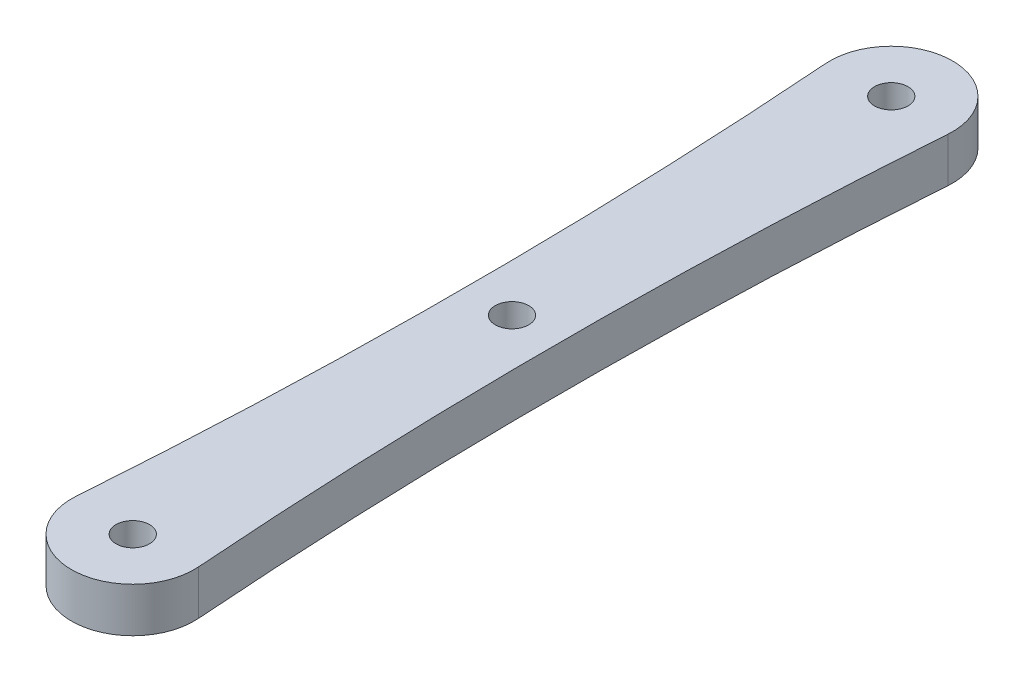
ISO-10303-21;
HEADER;
FILE_DESCRIPTION(('STEP AP214'),'2;1');
FILE_NAME('part.step','',(''),(''),'','','');
FILE_SCHEMA(('AUTOMOTIVE_DESIGN { 1 0 10303 214 1 1 1 1 }'));
ENDSEC;
DATA;
#1=APPLICATION_CONTEXT('core data for automotive mechanical design processes');
#2=APPLICATION_PROTOCOL_DEFINITION('international standard','automotive_design',2000,#1);
#3=PRODUCT_CONTEXT('',#1,'mechanical');
#4=PRODUCT('Part','Part','',(#3));
#5=PRODUCT_RELATED_PRODUCT_CATEGORY('part','',(#4));
#6=PRODUCT_DEFINITION_FORMATION('','',#4);
#7=PRODUCT_DEFINITION_CONTEXT('part definition',#1,'design');
#8=PRODUCT_DEFINITION('design','',#6,#7);
#9=PRODUCT_DEFINITION_SHAPE('','',#8);
#10=(LENGTH_UNIT() NAMED_UNIT(*) SI_UNIT(.MILLI.,.METRE.));
#11=(NAMED_UNIT(*) PLANE_ANGLE_UNIT() SI_UNIT($,.RADIAN.));
#12=(NAMED_UNIT(*) SI_UNIT($,.STERADIAN.) SOLID_ANGLE_UNIT());
#13=UNCERTAINTY_MEASURE_WITH_UNIT(LENGTH_MEASURE(1.E-05),#10,'distance_accuracy_value','');
#14=(GEOMETRIC_REPRESENTATION_CONTEXT(3) GLOBAL_UNCERTAINTY_ASSIGNED_CONTEXT((#13)) GLOBAL_UNIT_ASSIGNED_CONTEXT((#10,
#11,#12)) REPRESENTATION_CONTEXT('',''));
#15=CARTESIAN_POINT('',(0.,0.,0.));
#16=DIRECTION('',(0.,0.,1.));
#17=DIRECTION('',(1.,0.,0.));
#18=AXIS2_PLACEMENT_3D('',#15,#16,#17);
#19=CARTESIAN_POINT('',(-230.8875,4.,-16.9999999999999));
#20=DIRECTION('',(0.,-1.,0.));
#21=DIRECTION('',(0.,0.,-1.));
#22=AXIS2_PLACEMENT_3D('',#19,#20,#21);
#23=PLANE('',#22);
#24=CARTESIAN_POINT('',(-461.775,4.,-33.9999999999999));
#25=DIRECTION('',(0.,-1.,0.));
#26=DIRECTION('',(0.,0.,-1.));
#27=AXIS2_PLACEMENT_3D('',#24,#25,#26);
#28=CIRCLE('',#27,457.525);
#29=CARTESIAN_POINT('',(-5.48515198963337,4.,-67.5961341180282));
#30=VERTEX_POINT('',#29);
#31=CARTESIAN_POINT('',(-5.48515198963338,4.,-0.403865881971815));
#32=VERTEX_POINT('',#31);
#33=EDGE_CURVE('E83',#30,#32,#28,.T.);
#34=ORIENTED_EDGE('',*,*,#33,.T.);
#35=CARTESIAN_POINT('',(0.,4.,0.));
#36=DIRECTION('',(0.,1.,0.));
#37=DIRECTION('',(0.,0.,1.));
#38=AXIS2_PLACEMENT_3D('',#35,#36,#37);
#39=CIRCLE('',#38,5.49999999999999);
#40=CARTESIAN_POINT('',(5.48515198963334,4.,-0.403865881971853));
#41=VERTEX_POINT('',#40);
#42=EDGE_CURVE('E78',#32,#41,#39,.T.);
#43=ORIENTED_EDGE('',*,*,#42,.T.);
#44=CARTESIAN_POINT('',(461.775,4.,-33.9999999999999));
#45=DIRECTION('',(0.,-1.,0.));
#46=DIRECTION('',(0.,0.,1.));
#47=AXIS2_PLACEMENT_3D('',#44,#45,#46);
#48=CIRCLE('',#47,457.525);
#49=CARTESIAN_POINT('',(5.48515198963335,4.,-67.5961341180282));
#50=VERTEX_POINT('',#49);
#51=EDGE_CURVE('E81',#41,#50,#48,.T.);
#52=ORIENTED_EDGE('',*,*,#51,.T.);
#53=CARTESIAN_POINT('',(0.,4.,-68.));
#54=DIRECTION('',(0.,1.,0.));
#55=DIRECTION('',(0.,0.,1.));
#56=AXIS2_PLACEMENT_3D('',#53,#54,#55);
#57=CIRCLE('',#56,5.49999999999997);
#58=EDGE_CURVE('E48',#50,#30,#57,.T.);
#59=ORIENTED_EDGE('',*,*,#58,.T.);
#60=EDGE_LOOP('',(#34,#43,#52,#59));
#61=FACE_BOUND('',#60,.T.);
#62=CARTESIAN_POINT('',(0.,4.,-34.));
#63=DIRECTION('',(0.,1.,0.));
#64=DIRECTION('',(0.,0.,1.));
#65=AXIS2_PLACEMENT_3D('',#62,#63,#64);
#66=CIRCLE('',#65,1.5);
#67=CARTESIAN_POINT('',(0.,4.,-32.5));
#68=VERTEX_POINT('',#67);
#69=EDGE_CURVE('E98',#68,#68,#66,.T.);
#70=ORIENTED_EDGE('',*,*,#69,.F.);
#71=EDGE_LOOP('',(#70));
#72=FACE_BOUND('',#71,.T.);
#73=CARTESIAN_POINT('',(0.,4.,0.));
#74=DIRECTION('',(0.,1.,0.));
#75=DIRECTION('',(0.,0.,1.));
#76=AXIS2_PLACEMENT_3D('',#73,#74,#75);
#77=CIRCLE('',#76,1.5);
#78=CARTESIAN_POINT('',(0.,4.,1.5));
#79=VERTEX_POINT('',#78);
#80=EDGE_CURVE('E113',#79,#79,#77,.T.);
#81=ORIENTED_EDGE('',*,*,#80,.F.);
#82=EDGE_LOOP('',(#81));
#83=FACE_BOUND('',#82,.T.);
#84=CARTESIAN_POINT('',(0.,4.,-68.));
#85=DIRECTION('',(0.,1.,0.));
#86=DIRECTION('',(0.,0.,1.));
#87=AXIS2_PLACEMENT_3D('',#84,#85,#86);
#88=CIRCLE('',#87,1.5);
#89=CARTESIAN_POINT('',(0.,4.,-66.5));
#90=VERTEX_POINT('',#89);
#91=EDGE_CURVE('E119',#90,#90,#88,.T.);
#92=ORIENTED_EDGE('',*,*,#91,.F.);
#93=EDGE_LOOP('',(#92));
#94=FACE_BOUND('',#93,.T.);
#95=ADVANCED_FACE('F31',(#61,#72,#83,#94),#23,.F.);
#96=CARTESIAN_POINT('',(-230.8875,0.,-16.9999999999999));
#97=DIRECTION('',(0.,-1.,0.));
#98=DIRECTION('',(0.,0.,-1.));
#99=AXIS2_PLACEMENT_3D('',#96,#97,#98);
#100=PLANE('',#99);
#101=CARTESIAN_POINT('',(0.,0.,0.));
#102=DIRECTION('',(0.,1.,0.));
#103=DIRECTION('',(0.,0.,1.));
#104=AXIS2_PLACEMENT_3D('',#101,#102,#103);
#105=CIRCLE('',#104,1.5);
#106=CARTESIAN_POINT('',(0.,0.,1.5));
#107=VERTEX_POINT('',#106);
#108=EDGE_CURVE('E116',#107,#107,#105,.T.);
#109=ORIENTED_EDGE('',*,*,#108,.T.);
#110=EDGE_LOOP('',(#109));
#111=FACE_BOUND('',#110,.T.);
#112=CARTESIAN_POINT('',(-461.775,0.,-33.9999999999999));
#113=DIRECTION('',(0.,-1.,0.));
#114=DIRECTION('',(0.,0.,-1.));
#115=AXIS2_PLACEMENT_3D('',#112,#113,#114);
#116=CIRCLE('',#115,457.525);
#117=CARTESIAN_POINT('',(-5.48515198963337,0.,-67.5961341180282));
#118=VERTEX_POINT('',#117);
#119=CARTESIAN_POINT('',(-5.48515198963338,0.,-0.403865881971815));
#120=VERTEX_POINT('',#119);
#121=EDGE_CURVE('E95',#118,#120,#116,.T.);
#122=ORIENTED_EDGE('',*,*,#121,.F.);
#123=CARTESIAN_POINT('',(0.,0.,-68.));
#124=DIRECTION('',(0.,1.,0.));
#125=DIRECTION('',(0.,0.,1.));
#126=AXIS2_PLACEMENT_3D('',#123,#124,#125);
#127=CIRCLE('',#126,5.49999999999997);
#128=CARTESIAN_POINT('',(5.48515198963335,0.,-67.5961341180282));
#129=VERTEX_POINT('',#128);
#130=EDGE_CURVE('E71',#129,#118,#127,.T.);
#131=ORIENTED_EDGE('',*,*,#130,.F.);
#132=CARTESIAN_POINT('',(461.775,0.,-33.9999999999999));
#133=DIRECTION('',(0.,-1.,0.));
#134=DIRECTION('',(0.,0.,1.));
#135=AXIS2_PLACEMENT_3D('',#132,#133,#134);
#136=CIRCLE('',#135,457.525);
#137=CARTESIAN_POINT('',(5.48515198963334,0.,-0.403865881971853));
#138=VERTEX_POINT('',#137);
#139=EDGE_CURVE('E65',#138,#129,#136,.T.);
#140=ORIENTED_EDGE('',*,*,#139,.F.);
#141=CARTESIAN_POINT('',(0.,0.,0.));
#142=DIRECTION('',(0.,1.,0.));
#143=DIRECTION('',(0.,0.,1.));
#144=AXIS2_PLACEMENT_3D('',#141,#142,#143);
#145=CIRCLE('',#144,5.49999999999999);
#146=EDGE_CURVE('E87',#120,#138,#145,.T.);
#147=ORIENTED_EDGE('',*,*,#146,.F.);
#148=EDGE_LOOP('',(#122,#131,#140,#147));
#149=FACE_BOUND('',#148,.T.);
#150=CARTESIAN_POINT('',(0.,0.,-34.));
#151=DIRECTION('',(0.,1.,0.));
#152=DIRECTION('',(0.,0.,1.));
#153=AXIS2_PLACEMENT_3D('',#150,#151,#152);
#154=CIRCLE('',#153,1.5);
#155=CARTESIAN_POINT('',(0.,0.,-32.5));
#156=VERTEX_POINT('',#155);
#157=EDGE_CURVE('E110',#156,#156,#154,.T.);
#158=ORIENTED_EDGE('',*,*,#157,.T.);
#159=EDGE_LOOP('',(#158));
#160=FACE_BOUND('',#159,.T.);
#161=CARTESIAN_POINT('',(0.,0.,-68.));
#162=DIRECTION('',(0.,1.,0.));
#163=DIRECTION('',(0.,0.,1.));
#164=AXIS2_PLACEMENT_3D('',#161,#162,#163);
#165=CIRCLE('',#164,1.5);
#166=CARTESIAN_POINT('',(0.,0.,-66.5));
#167=VERTEX_POINT('',#166);
#168=EDGE_CURVE('E122',#167,#167,#165,.T.);
#169=ORIENTED_EDGE('',*,*,#168,.T.);
#170=EDGE_LOOP('',(#169));
#171=FACE_BOUND('',#170,.T.);
#172=ADVANCED_FACE('F106',(#111,#149,#160,#171),#100,.T.);
#173=CARTESIAN_POINT('',(-461.775,4.,-33.9999999999999));
#174=DIRECTION('',(0.,-1.,0.));
#175=DIRECTION('',(0.,0.,-1.));
#176=AXIS2_PLACEMENT_3D('',#173,#174,#175);
#177=CYLINDRICAL_SURFACE('',#176,457.525);
#178=ORIENTED_EDGE('',*,*,#121,.T.);
#179=DIRECTION('',(0.,-1.,0.));
#180=VECTOR('',#179,1.);
#181=CARTESIAN_POINT('',(-5.48515198963338,4.,-0.403865881971815));
#182=LINE('',#181,#180);
#183=EDGE_CURVE('E11',#32,#120,#182,.T.);
#184=ORIENTED_EDGE('',*,*,#183,.F.);
#185=ORIENTED_EDGE('',*,*,#33,.F.);
#186=DIRECTION('',(0.,-1.,0.));
#187=VECTOR('',#186,1.);
#188=CARTESIAN_POINT('',(-5.48515198963337,4.,-67.5961341180282));
#189=LINE('',#188,#187);
#190=EDGE_CURVE('E91',#30,#118,#189,.T.);
#191=ORIENTED_EDGE('',*,*,#190,.T.);
#192=EDGE_LOOP('',(#178,#184,#185,#191));
#193=FACE_BOUND('',#192,.T.);
#194=ADVANCED_FACE('F33',(#193),#177,.F.);
#195=CARTESIAN_POINT('',(0.,4.,0.));
#196=DIRECTION('',(0.,-1.,0.));
#197=DIRECTION('',(0.,0.,-1.));
#198=AXIS2_PLACEMENT_3D('',#195,#196,#197);
#199=CYLINDRICAL_SURFACE('',#198,5.49999999999999);
#200=ORIENTED_EDGE('',*,*,#146,.T.);
#201=DIRECTION('',(0.,-1.,0.));
#202=VECTOR('',#201,1.);
#203=CARTESIAN_POINT('',(5.48515198963334,4.,-0.403865881971853));
#204=LINE('',#203,#202);
#205=EDGE_CURVE('E40',#41,#138,#204,.T.);
#206=ORIENTED_EDGE('',*,*,#205,.F.);
#207=ORIENTED_EDGE('',*,*,#42,.F.);
#208=ORIENTED_EDGE('',*,*,#183,.T.);
#209=EDGE_LOOP('',(#200,#206,#207,#208));
#210=FACE_BOUND('',#209,.T.);
#211=ADVANCED_FACE('F86',(#210),#199,.T.);
#212=CARTESIAN_POINT('',(461.775,4.,-33.9999999999999));
#213=DIRECTION('',(0.,-1.,0.));
#214=DIRECTION('',(0.,0.,-1.));
#215=AXIS2_PLACEMENT_3D('',#212,#213,#214);
#216=CYLINDRICAL_SURFACE('',#215,457.525);
#217=ORIENTED_EDGE('',*,*,#139,.T.);
#218=DIRECTION('',(0.,-1.,0.));
#219=VECTOR('',#218,1.);
#220=CARTESIAN_POINT('',(5.48515198963335,4.,-67.5961341180282));
#221=LINE('',#220,#219);
#222=EDGE_CURVE('E88',#50,#129,#221,.T.);
#223=ORIENTED_EDGE('',*,*,#222,.F.);
#224=ORIENTED_EDGE('',*,*,#51,.F.);
#225=ORIENTED_EDGE('',*,*,#205,.T.);
#226=EDGE_LOOP('',(#217,#223,#224,#225));
#227=FACE_BOUND('',#226,.T.);
#228=ADVANCED_FACE('F89',(#227),#216,.F.);
#229=CARTESIAN_POINT('',(0.,4.,-68.));
#230=DIRECTION('',(0.,-1.,0.));
#231=DIRECTION('',(0.,0.,-1.));
#232=AXIS2_PLACEMENT_3D('',#229,#230,#231);
#233=CYLINDRICAL_SURFACE('',#232,5.49999999999997);
#234=ORIENTED_EDGE('',*,*,#130,.T.);
#235=ORIENTED_EDGE('',*,*,#190,.F.);
#236=ORIENTED_EDGE('',*,*,#58,.F.);
#237=ORIENTED_EDGE('',*,*,#222,.T.);
#238=EDGE_LOOP('',(#234,#235,#236,#237));
#239=FACE_BOUND('',#238,.T.);
#240=ADVANCED_FACE('F103',(#239),#233,.T.);
#241=CARTESIAN_POINT('',(0.,4.,-34.));
#242=DIRECTION('',(0.,-1.,0.));
#243=DIRECTION('',(0.,0.,-1.));
#244=AXIS2_PLACEMENT_3D('',#241,#242,#243);
#245=CYLINDRICAL_SURFACE('',#244,1.5);
#246=ORIENTED_EDGE('',*,*,#69,.T.);
#247=EDGE_LOOP('',(#246));
#248=FACE_BOUND('',#247,.T.);
#249=ORIENTED_EDGE('',*,*,#157,.F.);
#250=EDGE_LOOP('',(#249));
#251=FACE_BOUND('',#250,.T.);
#252=ADVANCED_FACE('F139',(#248,#251),#245,.F.);
#253=CARTESIAN_POINT('',(0.,4.,0.));
#254=DIRECTION('',(0.,-1.,0.));
#255=DIRECTION('',(0.,0.,-1.));
#256=AXIS2_PLACEMENT_3D('',#253,#254,#255);
#257=CYLINDRICAL_SURFACE('',#256,1.5);
#258=ORIENTED_EDGE('',*,*,#80,.T.);
#259=EDGE_LOOP('',(#258));
#260=FACE_BOUND('',#259,.T.);
#261=ORIENTED_EDGE('',*,*,#108,.F.);
#262=EDGE_LOOP('',(#261));
#263=FACE_BOUND('',#262,.T.);
#264=ADVANCED_FACE('F185',(#260,#263),#257,.F.);
#265=CARTESIAN_POINT('',(0.,4.,-68.));
#266=DIRECTION('',(0.,-1.,0.));
#267=DIRECTION('',(0.,0.,-1.));
#268=AXIS2_PLACEMENT_3D('',#265,#266,#267);
#269=CYLINDRICAL_SURFACE('',#268,1.5);
#270=ORIENTED_EDGE('',*,*,#91,.T.);
#271=EDGE_LOOP('',(#270));
#272=FACE_BOUND('',#271,.T.);
#273=ORIENTED_EDGE('',*,*,#168,.F.);
#274=EDGE_LOOP('',(#273));
#275=FACE_BOUND('',#274,.T.);
#276=ADVANCED_FACE('F128',(#272,#275),#269,.F.);
#277=CLOSED_SHELL('',(#95,#172,#194,#211,#228,#240,#252,#264,#276));
#278=MANIFOLD_SOLID_BREP('B2',#277);
#279=ADVANCED_BREP_SHAPE_REPRESENTATION('',(#18,#278),#14);
#280=SHAPE_DEFINITION_REPRESENTATION(#9,#279);
ENDSEC;
END-ISO-10303-21;
